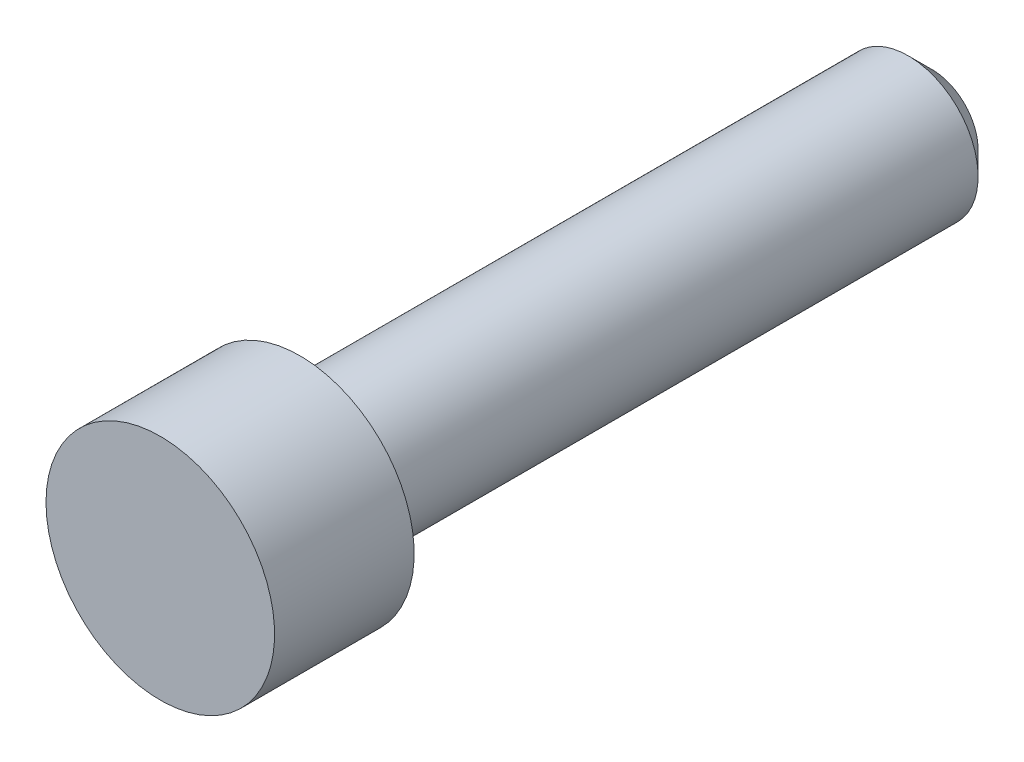
ISO-10303-21;
HEADER;
FILE_DESCRIPTION(('STEP AP214'),'2;1');
FILE_NAME('part.step','',(''),(''),'','','');
FILE_SCHEMA(('AUTOMOTIVE_DESIGN { 1 0 10303 214 1 1 1 1 }'));
ENDSEC;
DATA;
#1=APPLICATION_CONTEXT('core data for automotive mechanical design processes');
#2=APPLICATION_PROTOCOL_DEFINITION('international standard','automotive_design',2000,#1);
#3=PRODUCT_CONTEXT('',#1,'mechanical');
#4=PRODUCT('Part','Part','',(#3));
#5=PRODUCT_RELATED_PRODUCT_CATEGORY('part','',(#4));
#6=PRODUCT_DEFINITION_FORMATION('','',#4);
#7=PRODUCT_DEFINITION_CONTEXT('part definition',#1,'design');
#8=PRODUCT_DEFINITION('design','',#6,#7);
#9=PRODUCT_DEFINITION_SHAPE('','',#8);
#10=(LENGTH_UNIT() NAMED_UNIT(*) SI_UNIT(.MILLI.,.METRE.));
#11=(NAMED_UNIT(*) PLANE_ANGLE_UNIT() SI_UNIT($,.RADIAN.));
#12=(NAMED_UNIT(*) SI_UNIT($,.STERADIAN.) SOLID_ANGLE_UNIT());
#13=UNCERTAINTY_MEASURE_WITH_UNIT(LENGTH_MEASURE(1.E-05),#10,'distance_accuracy_value','');
#14=(GEOMETRIC_REPRESENTATION_CONTEXT(3) GLOBAL_UNCERTAINTY_ASSIGNED_CONTEXT((#13)) GLOBAL_UNIT_ASSIGNED_CONTEXT((#10,
#11,#12)) REPRESENTATION_CONTEXT('',''));
#15=CARTESIAN_POINT('',(0.,0.,0.));
#16=DIRECTION('',(0.,0.,1.));
#17=DIRECTION('',(1.,0.,0.));
#18=AXIS2_PLACEMENT_3D('',#15,#16,#17);
#19=CARTESIAN_POINT('',(0.,2.8702,9.6901));
#20=DIRECTION('',(0.,0.,1.));
#21=DIRECTION('',(1.,0.,0.));
#22=AXIS2_PLACEMENT_3D('',#19,#20,#21);
#23=PLANE('',#22);
#24=CARTESIAN_POINT('',(0.,0.,9.6901));
#25=DIRECTION('',(0.,0.,-1.));
#26=DIRECTION('',(-1.,0.,0.));
#27=AXIS2_PLACEMENT_3D('',#24,#25,#26);
#28=CIRCLE('',#27,2.8702);
#29=CARTESIAN_POINT('',(-2.8702,0.,9.6901));
#30=VERTEX_POINT('',#29);
#31=EDGE_CURVE('E10',#30,#30,#28,.T.);
#32=ORIENTED_EDGE('',*,*,#31,.F.);
#33=EDGE_LOOP('',(#32));
#34=FACE_BOUND('',#33,.T.);
#35=ADVANCED_FACE('F35',(#34),#23,.T.);
#36=CARTESIAN_POINT('',(0.,0.,-9.6901));
#37=DIRECTION('',(0.,0.,-1.));
#38=DIRECTION('',(-1.,0.,0.));
#39=AXIS2_PLACEMENT_3D('',#36,#37,#38);
#40=CYLINDRICAL_SURFACE('',#39,2.8702);
#41=ORIENTED_EDGE('',*,*,#31,.T.);
#42=EDGE_LOOP('',(#41));
#43=FACE_BOUND('',#42,.T.);
#44=CARTESIAN_POINT('',(0.,0.,6.1849));
#45=DIRECTION('',(0.,0.,-1.));
#46=DIRECTION('',(-1.,0.,0.));
#47=AXIS2_PLACEMENT_3D('',#44,#45,#46);
#48=CIRCLE('',#47,2.8702);
#49=CARTESIAN_POINT('',(-2.8702,0.,6.1849));
#50=VERTEX_POINT('',#49);
#51=EDGE_CURVE('E41',#50,#50,#48,.T.);
#52=ORIENTED_EDGE('',*,*,#51,.F.);
#53=EDGE_LOOP('',(#52));
#54=FACE_BOUND('',#53,.T.);
#55=ADVANCED_FACE('F74',(#43,#54),#40,.T.);
#56=CARTESIAN_POINT('',(0.,2.8702,6.1849));
#57=DIRECTION('',(0.,0.,-1.));
#58=DIRECTION('',(-1.,0.,0.));
#59=AXIS2_PLACEMENT_3D('',#56,#57,#58);
#60=PLANE('',#59);
#61=ORIENTED_EDGE('',*,*,#51,.T.);
#62=EDGE_LOOP('',(#61));
#63=FACE_BOUND('',#62,.T.);
#64=CARTESIAN_POINT('',(0.,0.,6.1849));
#65=DIRECTION('',(0.,0.,-1.));
#66=DIRECTION('',(-1.,0.,0.));
#67=AXIS2_PLACEMENT_3D('',#64,#65,#66);
#68=CIRCLE('',#67,1.7526);
#69=CARTESIAN_POINT('',(-1.7526,0.,6.1849));
#70=VERTEX_POINT('',#69);
#71=EDGE_CURVE('E45',#70,#70,#68,.T.);
#72=ORIENTED_EDGE('',*,*,#71,.F.);
#73=EDGE_LOOP('',(#72));
#74=FACE_BOUND('',#73,.T.);
#75=ADVANCED_FACE('F70',(#63,#74),#60,.T.);
#76=CARTESIAN_POINT('',(0.,0.,-9.6901));
#77=DIRECTION('',(0.,0.,-1.));
#78=DIRECTION('',(-1.,0.,0.));
#79=AXIS2_PLACEMENT_3D('',#76,#77,#78);
#80=CYLINDRICAL_SURFACE('',#79,1.7526);
#81=ORIENTED_EDGE('',*,*,#71,.T.);
#82=EDGE_LOOP('',(#81));
#83=FACE_BOUND('',#82,.T.);
#84=CARTESIAN_POINT('',(0.,0.,-9.0947875));
#85=DIRECTION('',(0.,0.,-1.));
#86=DIRECTION('',(-1.,0.,0.));
#87=AXIS2_PLACEMENT_3D('',#84,#85,#86);
#88=CIRCLE('',#87,1.7526);
#89=CARTESIAN_POINT('',(-1.7526,0.,-9.0947875));
#90=VERTEX_POINT('',#89);
#91=EDGE_CURVE('E49',#90,#90,#88,.T.);
#92=ORIENTED_EDGE('',*,*,#91,.F.);
#93=EDGE_LOOP('',(#92));
#94=FACE_BOUND('',#93,.T.);
#95=ADVANCED_FACE('F62',(#83,#94),#80,.T.);
#96=CARTESIAN_POINT('',(0.,0.,-9.6901));
#97=DIRECTION('',(0.,0.,1.));
#98=DIRECTION('',(1.,0.,0.));
#99=AXIS2_PLACEMENT_3D('',#96,#97,#98);
#100=CONICAL_SURFACE('',#99,1.1572875,0.785398163397444);
#101=ORIENTED_EDGE('',*,*,#91,.T.);
#102=EDGE_LOOP('',(#101));
#103=FACE_BOUND('',#102,.T.);
#104=CARTESIAN_POINT('',(0.,0.,-9.6901));
#105=DIRECTION('',(0.,0.,-1.));
#106=DIRECTION('',(-1.,0.,0.));
#107=AXIS2_PLACEMENT_3D('',#104,#105,#106);
#108=CIRCLE('',#107,1.1572875);
#109=CARTESIAN_POINT('',(-1.1572875,0.,-9.6901));
#110=VERTEX_POINT('',#109);
#111=EDGE_CURVE('E54',#110,#110,#108,.T.);
#112=ORIENTED_EDGE('',*,*,#111,.F.);
#113=EDGE_LOOP('',(#112));
#114=FACE_BOUND('',#113,.T.);
#115=ADVANCED_FACE('F60',(#103,#114),#100,.T.);
#116=CARTESIAN_POINT('',(0.,1.1572875,-9.6901));
#117=DIRECTION('',(0.,0.,-1.));
#118=DIRECTION('',(-1.,0.,0.));
#119=AXIS2_PLACEMENT_3D('',#116,#117,#118);
#120=PLANE('',#119);
#121=ORIENTED_EDGE('',*,*,#111,.T.);
#122=EDGE_LOOP('',(#121));
#123=FACE_BOUND('',#122,.T.);
#124=ADVANCED_FACE('F58',(#123),#120,.T.);
#125=CLOSED_SHELL('',(#35,#55,#75,#95,#115,#124));
#126=MANIFOLD_SOLID_BREP('B2',#125);
#127=ADVANCED_BREP_SHAPE_REPRESENTATION('',(#18,#126),#14);
#128=SHAPE_DEFINITION_REPRESENTATION(#9,#127);
ENDSEC;
END-ISO-10303-21;
